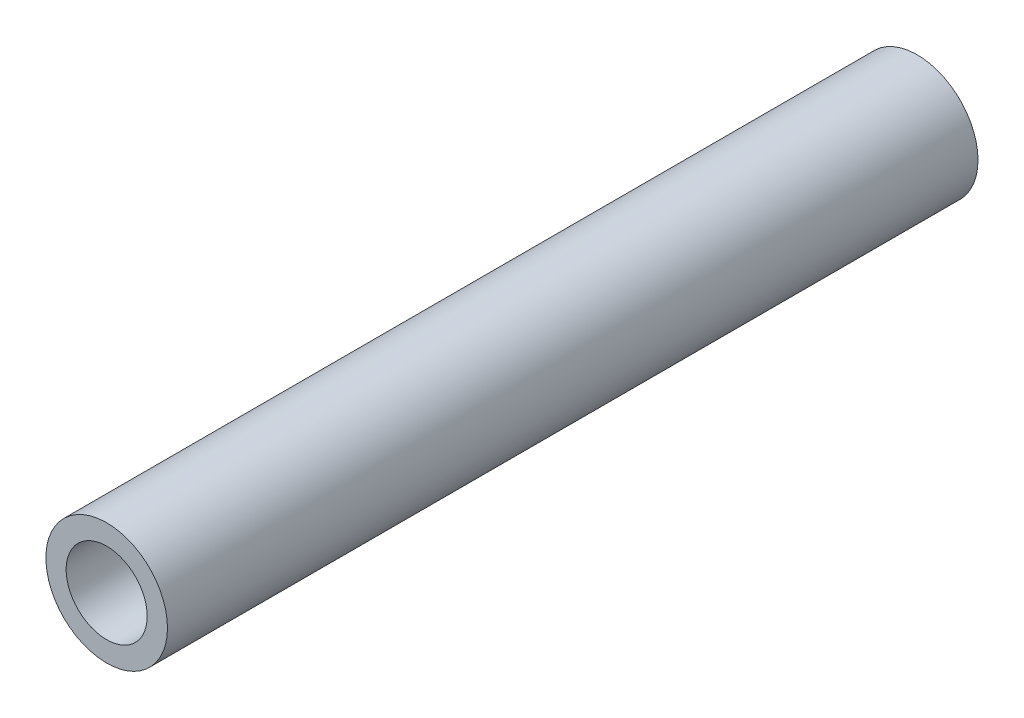
ISO-10303-21;
HEADER;
FILE_DESCRIPTION(('STEP AP214'),'2;1');
FILE_NAME('part.step','',(''),(''),'','','');
FILE_SCHEMA(('AUTOMOTIVE_DESIGN { 1 0 10303 214 1 1 1 1 }'));
ENDSEC;
DATA;
#1=APPLICATION_CONTEXT('core data for automotive mechanical design processes');
#2=APPLICATION_PROTOCOL_DEFINITION('international standard','automotive_design',2000,#1);
#3=PRODUCT_CONTEXT('',#1,'mechanical');
#4=PRODUCT('Part','Part','',(#3));
#5=PRODUCT_RELATED_PRODUCT_CATEGORY('part','',(#4));
#6=PRODUCT_DEFINITION_FORMATION('','',#4);
#7=PRODUCT_DEFINITION_CONTEXT('part definition',#1,'design');
#8=PRODUCT_DEFINITION('design','',#6,#7);
#9=PRODUCT_DEFINITION_SHAPE('','',#8);
#10=(LENGTH_UNIT() NAMED_UNIT(*) SI_UNIT(.MILLI.,.METRE.));
#11=(NAMED_UNIT(*) PLANE_ANGLE_UNIT() SI_UNIT($,.RADIAN.));
#12=(NAMED_UNIT(*) SI_UNIT($,.STERADIAN.) SOLID_ANGLE_UNIT());
#13=UNCERTAINTY_MEASURE_WITH_UNIT(LENGTH_MEASURE(1.E-05),#10,'distance_accuracy_value','');
#14=(GEOMETRIC_REPRESENTATION_CONTEXT(3) GLOBAL_UNCERTAINTY_ASSIGNED_CONTEXT((#13)) GLOBAL_UNIT_ASSIGNED_CONTEXT((#10,
#11,#12)) REPRESENTATION_CONTEXT('',''));
#15=CARTESIAN_POINT('',(0.,0.,0.));
#16=DIRECTION('',(0.,0.,1.));
#17=DIRECTION('',(1.,0.,0.));
#18=AXIS2_PLACEMENT_3D('',#15,#16,#17);
#19=CARTESIAN_POINT('',(0.,0.,127.));
#20=DIRECTION('',(0.,0.,1.));
#21=DIRECTION('',(1.,0.,0.));
#22=AXIS2_PLACEMENT_3D('',#19,#20,#21);
#23=CYLINDRICAL_SURFACE('',#22,6.35);
#24=CARTESIAN_POINT('',(0.,0.,127.));
#25=DIRECTION('',(0.,0.,1.));
#26=DIRECTION('',(1.,0.,0.));
#27=AXIS2_PLACEMENT_3D('',#24,#25,#26);
#28=CIRCLE('',#27,6.35);
#29=CARTESIAN_POINT('',(6.35,0.,127.));
#30=VERTEX_POINT('',#29);
#31=EDGE_CURVE('E17',#30,#30,#28,.F.);
#32=ORIENTED_EDGE('',*,*,#31,.F.);
#33=EDGE_LOOP('',(#32));
#34=FACE_BOUND('',#33,.T.);
#35=CARTESIAN_POINT('',(0.,0.,0.));
#36=DIRECTION('',(0.,0.,1.));
#37=DIRECTION('',(1.,0.,0.));
#38=AXIS2_PLACEMENT_3D('',#35,#36,#37);
#39=CIRCLE('',#38,6.35);
#40=CARTESIAN_POINT('',(6.35,0.,0.));
#41=VERTEX_POINT('',#40);
#42=EDGE_CURVE('E26',#41,#41,#39,.F.);
#43=ORIENTED_EDGE('',*,*,#42,.T.);
#44=EDGE_LOOP('',(#43));
#45=FACE_BOUND('',#44,.T.);
#46=ADVANCED_FACE('F14',(#34,#45),#23,.F.);
#47=CARTESIAN_POINT('',(0.,0.,127.));
#48=DIRECTION('',(0.,0.,1.));
#49=DIRECTION('',(1.,0.,0.));
#50=AXIS2_PLACEMENT_3D('',#47,#48,#49);
#51=PLANE('',#50);
#52=ORIENTED_EDGE('',*,*,#31,.T.);
#53=EDGE_LOOP('',(#52));
#54=FACE_BOUND('',#53,.T.);
#55=CARTESIAN_POINT('',(0.,0.,127.));
#56=DIRECTION('',(0.,0.,1.));
#57=DIRECTION('',(1.,0.,0.));
#58=AXIS2_PLACEMENT_3D('',#55,#56,#57);
#59=CIRCLE('',#58,9.525);
#60=CARTESIAN_POINT('',(9.525,0.,127.));
#61=VERTEX_POINT('',#60);
#62=EDGE_CURVE('E21',#61,#61,#59,.F.);
#63=ORIENTED_EDGE('',*,*,#62,.F.);
#64=EDGE_LOOP('',(#63));
#65=FACE_BOUND('',#64,.T.);
#66=ADVANCED_FACE('F34',(#54,#65),#51,.T.);
#67=CARTESIAN_POINT('',(0.,0.,0.));
#68=DIRECTION('',(0.,0.,1.));
#69=DIRECTION('',(1.,0.,0.));
#70=AXIS2_PLACEMENT_3D('',#67,#68,#69);
#71=PLANE('',#70);
#72=ORIENTED_EDGE('',*,*,#42,.F.);
#73=EDGE_LOOP('',(#72));
#74=FACE_BOUND('',#73,.T.);
#75=CARTESIAN_POINT('',(0.,0.,0.));
#76=DIRECTION('',(0.,0.,1.));
#77=DIRECTION('',(1.,0.,0.));
#78=AXIS2_PLACEMENT_3D('',#75,#76,#77);
#79=CIRCLE('',#78,9.525);
#80=CARTESIAN_POINT('',(9.525,0.,0.));
#81=VERTEX_POINT('',#80);
#82=EDGE_CURVE('E9',#81,#81,#79,.T.);
#83=ORIENTED_EDGE('',*,*,#82,.F.);
#84=EDGE_LOOP('',(#83));
#85=FACE_BOUND('',#84,.T.);
#86=ADVANCED_FACE('F42',(#74,#85),#71,.F.);
#87=CARTESIAN_POINT('',(0.,0.,0.));
#88=DIRECTION('',(0.,0.,1.));
#89=DIRECTION('',(1.,0.,0.));
#90=AXIS2_PLACEMENT_3D('',#87,#88,#89);
#91=CYLINDRICAL_SURFACE('',#90,9.525);
#92=ORIENTED_EDGE('',*,*,#62,.T.);
#93=EDGE_LOOP('',(#92));
#94=FACE_BOUND('',#93,.T.);
#95=ORIENTED_EDGE('',*,*,#82,.T.);
#96=EDGE_LOOP('',(#95));
#97=FACE_BOUND('',#96,.T.);
#98=ADVANCED_FACE('F43',(#94,#97),#91,.T.);
#99=CLOSED_SHELL('',(#46,#66,#86,#98));
#100=MANIFOLD_SOLID_BREP('B1',#99);
#101=ADVANCED_BREP_SHAPE_REPRESENTATION('',(#18,#100),#14);
#102=SHAPE_DEFINITION_REPRESENTATION(#9,#101);
ENDSEC;
END-ISO-10303-21;
